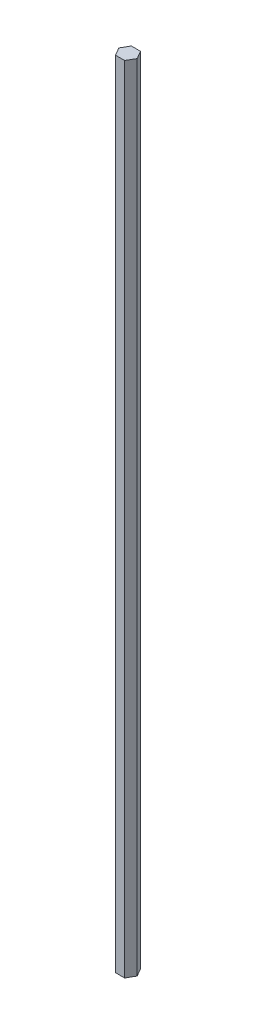
ISO-10303-21;
HEADER;
FILE_DESCRIPTION(('STEP AP214'),'2;1');
FILE_NAME('part.step','',(''),(''),'','','');
FILE_SCHEMA(('AUTOMOTIVE_DESIGN { 1 0 10303 214 1 1 1 1 }'));
ENDSEC;
DATA;
#1=APPLICATION_CONTEXT('core data for automotive mechanical design processes');
#2=APPLICATION_PROTOCOL_DEFINITION('international standard','automotive_design',2000,#1);
#3=PRODUCT_CONTEXT('',#1,'mechanical');
#4=PRODUCT('Part','Part','',(#3));
#5=PRODUCT_RELATED_PRODUCT_CATEGORY('part','',(#4));
#6=PRODUCT_DEFINITION_FORMATION('','',#4);
#7=PRODUCT_DEFINITION_CONTEXT('part definition',#1,'design');
#8=PRODUCT_DEFINITION('design','',#6,#7);
#9=PRODUCT_DEFINITION_SHAPE('','',#8);
#10=(LENGTH_UNIT() NAMED_UNIT(*) SI_UNIT(.MILLI.,.METRE.));
#11=(NAMED_UNIT(*) PLANE_ANGLE_UNIT() SI_UNIT($,.RADIAN.));
#12=(NAMED_UNIT(*) SI_UNIT($,.STERADIAN.) SOLID_ANGLE_UNIT());
#13=UNCERTAINTY_MEASURE_WITH_UNIT(LENGTH_MEASURE(1.E-05),#10,'distance_accuracy_value','');
#14=(GEOMETRIC_REPRESENTATION_CONTEXT(3) GLOBAL_UNCERTAINTY_ASSIGNED_CONTEXT((#13)) GLOBAL_UNIT_ASSIGNED_CONTEXT((#10,
#11,#12)) REPRESENTATION_CONTEXT('',''));
#15=CARTESIAN_POINT('',(0.,0.,0.));
#16=DIRECTION('',(0.,0.,1.));
#17=DIRECTION('',(1.,0.,0.));
#18=AXIS2_PLACEMENT_3D('',#15,#16,#17);
#19=CARTESIAN_POINT('',(-3.66617420935413,635.,6.35));
#20=DIRECTION('',(0.,0.,-1.));
#21=DIRECTION('',(-1.,0.,0.));
#22=AXIS2_PLACEMENT_3D('',#19,#20,#21);
#23=PLANE('',#22);
#24=DIRECTION('',(1.,0.,0.));
#25=VECTOR('',#24,1.);
#26=CARTESIAN_POINT('',(-3.66617420935413,0.,6.35));
#27=LINE('',#26,#25);
#28=CARTESIAN_POINT('',(-3.66617420935413,0.,6.35));
#29=VERTEX_POINT('',#28);
#30=CARTESIAN_POINT('',(3.66617420935412,0.,6.35));
#31=VERTEX_POINT('',#30);
#32=EDGE_CURVE('E119',#29,#31,#27,.T.);
#33=ORIENTED_EDGE('',*,*,#32,.T.);
#34=DIRECTION('',(0.,-1.,0.));
#35=VECTOR('',#34,1.);
#36=CARTESIAN_POINT('',(3.66617420935412,635.,6.35));
#37=LINE('',#36,#35);
#38=CARTESIAN_POINT('',(3.66617420935412,635.,6.35));
#39=VERTEX_POINT('',#38);
#40=EDGE_CURVE('E11',#39,#31,#37,.T.);
#41=ORIENTED_EDGE('',*,*,#40,.F.);
#42=DIRECTION('',(1.,0.,0.));
#43=VECTOR('',#42,1.);
#44=CARTESIAN_POINT('',(-3.66617420935413,635.,6.35));
#45=LINE('',#44,#43);
#46=CARTESIAN_POINT('',(-3.66617420935413,635.,6.35));
#47=VERTEX_POINT('',#46);
#48=EDGE_CURVE('E129',#47,#39,#45,.T.);
#49=ORIENTED_EDGE('',*,*,#48,.F.);
#50=DIRECTION('',(0.,-1.,0.));
#51=VECTOR('',#50,1.);
#52=CARTESIAN_POINT('',(-3.66617420935413,635.,6.35));
#53=LINE('',#52,#51);
#54=EDGE_CURVE('E115',#47,#29,#53,.T.);
#55=ORIENTED_EDGE('',*,*,#54,.T.);
#56=EDGE_LOOP('',(#33,#41,#49,#55));
#57=FACE_BOUND('',#56,.T.);
#58=ADVANCED_FACE('F35',(#57),#23,.F.);
#59=CARTESIAN_POINT('',(3.66617420935412,635.,6.35));
#60=DIRECTION('',(-0.866025403784438,0.,-0.5));
#61=DIRECTION('',(-0.5,0.,0.866025403784439));
#62=AXIS2_PLACEMENT_3D('',#59,#60,#61);
#63=PLANE('',#62);
#64=DIRECTION('',(0.5,0.,-0.866025403784438));
#65=VECTOR('',#64,1.);
#66=CARTESIAN_POINT('',(3.66617420935412,0.,6.35));
#67=LINE('',#66,#65);
#68=CARTESIAN_POINT('',(7.33234841870825,0.,0.));
#69=VERTEX_POINT('',#68);
#70=EDGE_CURVE('E122',#31,#69,#67,.T.);
#71=ORIENTED_EDGE('',*,*,#70,.T.);
#72=DIRECTION('',(0.,-1.,0.));
#73=VECTOR('',#72,1.);
#74=CARTESIAN_POINT('',(7.33234841870825,635.,0.));
#75=LINE('',#74,#73);
#76=CARTESIAN_POINT('',(7.33234841870825,635.,0.));
#77=VERTEX_POINT('',#76);
#78=EDGE_CURVE('E43',#77,#69,#75,.T.);
#79=ORIENTED_EDGE('',*,*,#78,.F.);
#80=DIRECTION('',(0.5,0.,-0.866025403784438));
#81=VECTOR('',#80,1.);
#82=CARTESIAN_POINT('',(3.66617420935412,635.,6.35));
#83=LINE('',#82,#81);
#84=EDGE_CURVE('E88',#39,#77,#83,.T.);
#85=ORIENTED_EDGE('',*,*,#84,.F.);
#86=ORIENTED_EDGE('',*,*,#40,.T.);
#87=EDGE_LOOP('',(#71,#79,#85,#86));
#88=FACE_BOUND('',#87,.T.);
#89=ADVANCED_FACE('F153',(#88),#63,.F.);
#90=CARTESIAN_POINT('',(7.33234841870825,635.,0.));
#91=DIRECTION('',(-0.866025403784439,0.,0.5));
#92=DIRECTION('',(0.5,0.,0.866025403784439));
#93=AXIS2_PLACEMENT_3D('',#90,#91,#92);
#94=PLANE('',#93);
#95=DIRECTION('',(-0.5,0.,-0.866025403784439));
#96=VECTOR('',#95,1.);
#97=CARTESIAN_POINT('',(7.33234841870825,0.,0.));
#98=LINE('',#97,#96);
#99=CARTESIAN_POINT('',(3.66617420935413,0.,-6.35));
#100=VERTEX_POINT('',#99);
#101=EDGE_CURVE('E124',#69,#100,#98,.T.);
#102=ORIENTED_EDGE('',*,*,#101,.T.);
#103=DIRECTION('',(0.,-1.,0.));
#104=VECTOR('',#103,1.);
#105=CARTESIAN_POINT('',(3.66617420935413,635.,-6.35));
#106=LINE('',#105,#104);
#107=CARTESIAN_POINT('',(3.66617420935413,635.,-6.35));
#108=VERTEX_POINT('',#107);
#109=EDGE_CURVE('E110',#108,#100,#106,.T.);
#110=ORIENTED_EDGE('',*,*,#109,.F.);
#111=DIRECTION('',(-0.5,0.,-0.866025403784439));
#112=VECTOR('',#111,1.);
#113=CARTESIAN_POINT('',(7.33234841870825,635.,0.));
#114=LINE('',#113,#112);
#115=EDGE_CURVE('E101',#77,#108,#114,.T.);
#116=ORIENTED_EDGE('',*,*,#115,.F.);
#117=ORIENTED_EDGE('',*,*,#78,.T.);
#118=EDGE_LOOP('',(#102,#110,#116,#117));
#119=FACE_BOUND('',#118,.T.);
#120=ADVANCED_FACE('F135',(#119),#94,.F.);
#121=CARTESIAN_POINT('',(3.66617420935413,635.,-6.35));
#122=DIRECTION('',(0.,0.,1.));
#123=DIRECTION('',(1.,0.,0.));
#124=AXIS2_PLACEMENT_3D('',#121,#122,#123);
#125=PLANE('',#124);
#126=DIRECTION('',(-1.,0.,0.));
#127=VECTOR('',#126,1.);
#128=CARTESIAN_POINT('',(3.66617420935413,0.,-6.35));
#129=LINE('',#128,#127);
#130=CARTESIAN_POINT('',(-3.66617420935412,0.,-6.35));
#131=VERTEX_POINT('',#130);
#132=EDGE_CURVE('E109',#100,#131,#129,.T.);
#133=ORIENTED_EDGE('',*,*,#132,.T.);
#134=DIRECTION('',(0.,-1.,0.));
#135=VECTOR('',#134,1.);
#136=CARTESIAN_POINT('',(-3.66617420935412,635.,-6.35));
#137=LINE('',#136,#135);
#138=CARTESIAN_POINT('',(-3.66617420935412,635.,-6.35));
#139=VERTEX_POINT('',#138);
#140=EDGE_CURVE('E106',#139,#131,#137,.T.);
#141=ORIENTED_EDGE('',*,*,#140,.F.);
#142=DIRECTION('',(-1.,0.,0.));
#143=VECTOR('',#142,1.);
#144=CARTESIAN_POINT('',(3.66617420935413,635.,-6.35));
#145=LINE('',#144,#143);
#146=EDGE_CURVE('E95',#108,#139,#145,.T.);
#147=ORIENTED_EDGE('',*,*,#146,.F.);
#148=ORIENTED_EDGE('',*,*,#109,.T.);
#149=EDGE_LOOP('',(#133,#141,#147,#148));
#150=FACE_BOUND('',#149,.T.);
#151=ADVANCED_FACE('F107',(#150),#125,.F.);
#152=CARTESIAN_POINT('',(-3.66617420935412,635.,-6.35));
#153=DIRECTION('',(0.866025403784438,0.,0.5));
#154=DIRECTION('',(0.5,0.,-0.866025403784439));
#155=AXIS2_PLACEMENT_3D('',#152,#153,#154);
#156=PLANE('',#155);
#157=DIRECTION('',(-0.5,0.,0.866025403784439));
#158=VECTOR('',#157,1.);
#159=CARTESIAN_POINT('',(-3.66617420935412,0.,-6.35));
#160=LINE('',#159,#158);
#161=CARTESIAN_POINT('',(-7.33234841870825,0.,0.));
#162=VERTEX_POINT('',#161);
#163=EDGE_CURVE('E74',#131,#162,#160,.T.);
#164=ORIENTED_EDGE('',*,*,#163,.T.);
#165=DIRECTION('',(0.,-1.,0.));
#166=VECTOR('',#165,1.);
#167=CARTESIAN_POINT('',(-7.33234841870825,635.,0.));
#168=LINE('',#167,#166);
#169=CARTESIAN_POINT('',(-7.33234841870825,635.,0.));
#170=VERTEX_POINT('',#169);
#171=EDGE_CURVE('E111',#170,#162,#168,.T.);
#172=ORIENTED_EDGE('',*,*,#171,.F.);
#173=DIRECTION('',(-0.5,0.,0.866025403784439));
#174=VECTOR('',#173,1.);
#175=CARTESIAN_POINT('',(-3.66617420935412,635.,-6.35));
#176=LINE('',#175,#174);
#177=EDGE_CURVE('E99',#139,#170,#176,.T.);
#178=ORIENTED_EDGE('',*,*,#177,.F.);
#179=ORIENTED_EDGE('',*,*,#140,.T.);
#180=EDGE_LOOP('',(#164,#172,#178,#179));
#181=FACE_BOUND('',#180,.T.);
#182=ADVANCED_FACE('F113',(#181),#156,.F.);
#183=CARTESIAN_POINT('',(-7.33234841870825,635.,0.));
#184=DIRECTION('',(0.866025403784439,0.,-0.5));
#185=DIRECTION('',(-0.5,0.,-0.866025403784439));
#186=AXIS2_PLACEMENT_3D('',#183,#184,#185);
#187=PLANE('',#186);
#188=DIRECTION('',(0.5,0.,0.866025403784439));
#189=VECTOR('',#188,1.);
#190=CARTESIAN_POINT('',(-7.33234841870825,0.,0.));
#191=LINE('',#190,#189);
#192=EDGE_CURVE('E80',#162,#29,#191,.T.);
#193=ORIENTED_EDGE('',*,*,#192,.T.);
#194=ORIENTED_EDGE('',*,*,#54,.F.);
#195=DIRECTION('',(0.5,0.,0.866025403784439));
#196=VECTOR('',#195,1.);
#197=CARTESIAN_POINT('',(-7.33234841870825,635.,0.));
#198=LINE('',#197,#196);
#199=EDGE_CURVE('E51',#170,#47,#198,.T.);
#200=ORIENTED_EDGE('',*,*,#199,.F.);
#201=ORIENTED_EDGE('',*,*,#171,.T.);
#202=EDGE_LOOP('',(#193,#194,#200,#201));
#203=FACE_BOUND('',#202,.T.);
#204=ADVANCED_FACE('F142',(#203),#187,.F.);
#205=CARTESIAN_POINT('',(0.,635.,0.));
#206=DIRECTION('',(0.,1.,0.));
#207=DIRECTION('',(0.,0.,1.));
#208=AXIS2_PLACEMENT_3D('',#205,#206,#207);
#209=PLANE('',#208);
#210=ORIENTED_EDGE('',*,*,#48,.T.);
#211=ORIENTED_EDGE('',*,*,#84,.T.);
#212=ORIENTED_EDGE('',*,*,#115,.T.);
#213=ORIENTED_EDGE('',*,*,#146,.T.);
#214=ORIENTED_EDGE('',*,*,#177,.T.);
#215=ORIENTED_EDGE('',*,*,#199,.T.);
#216=EDGE_LOOP('',(#210,#211,#212,#213,#214,#215));
#217=FACE_BOUND('',#216,.T.);
#218=ADVANCED_FACE('F97',(#217),#209,.T.);
#219=CARTESIAN_POINT('',(0.,0.,0.));
#220=DIRECTION('',(0.,1.,0.));
#221=DIRECTION('',(0.,0.,1.));
#222=AXIS2_PLACEMENT_3D('',#219,#220,#221);
#223=PLANE('',#222);
#224=ORIENTED_EDGE('',*,*,#32,.F.);
#225=ORIENTED_EDGE('',*,*,#192,.F.);
#226=ORIENTED_EDGE('',*,*,#163,.F.);
#227=ORIENTED_EDGE('',*,*,#132,.F.);
#228=ORIENTED_EDGE('',*,*,#101,.F.);
#229=ORIENTED_EDGE('',*,*,#70,.F.);
#230=EDGE_LOOP('',(#224,#225,#226,#227,#228,#229));
#231=FACE_BOUND('',#230,.T.);
#232=ADVANCED_FACE('F138',(#231),#223,.F.);
#233=CLOSED_SHELL('',(#58,#89,#120,#151,#182,#204,#218,#232));
#234=MANIFOLD_SOLID_BREP('B2',#233);
#235=ADVANCED_BREP_SHAPE_REPRESENTATION('',(#18,#234),#14);
#236=SHAPE_DEFINITION_REPRESENTATION(#9,#235);
ENDSEC;
END-ISO-10303-21;
